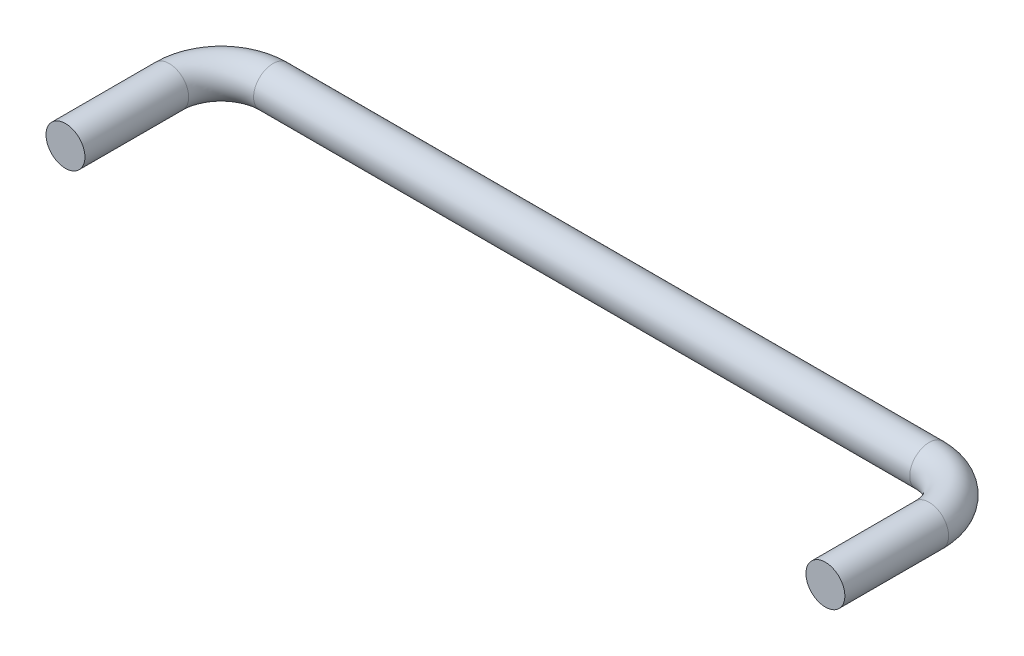
ISO-10303-21;
HEADER;
FILE_DESCRIPTION(('STEP AP214'),'2;1');
FILE_NAME('part.step','',(''),(''),'','','');
FILE_SCHEMA(('AUTOMOTIVE_DESIGN { 1 0 10303 214 1 1 1 1 }'));
ENDSEC;
DATA;
#1=APPLICATION_CONTEXT('core data for automotive mechanical design processes');
#2=APPLICATION_PROTOCOL_DEFINITION('international standard','automotive_design',2000,#1);
#3=PRODUCT_CONTEXT('',#1,'mechanical');
#4=PRODUCT('Part','Part','',(#3));
#5=PRODUCT_RELATED_PRODUCT_CATEGORY('part','',(#4));
#6=PRODUCT_DEFINITION_FORMATION('','',#4);
#7=PRODUCT_DEFINITION_CONTEXT('part definition',#1,'design');
#8=PRODUCT_DEFINITION('design','',#6,#7);
#9=PRODUCT_DEFINITION_SHAPE('','',#8);
#10=(LENGTH_UNIT() NAMED_UNIT(*) SI_UNIT(.MILLI.,.METRE.));
#11=(NAMED_UNIT(*) PLANE_ANGLE_UNIT() SI_UNIT($,.RADIAN.));
#12=(NAMED_UNIT(*) SI_UNIT($,.STERADIAN.) SOLID_ANGLE_UNIT());
#13=UNCERTAINTY_MEASURE_WITH_UNIT(LENGTH_MEASURE(1.E-05),#10,'distance_accuracy_value','');
#14=(GEOMETRIC_REPRESENTATION_CONTEXT(3) GLOBAL_UNCERTAINTY_ASSIGNED_CONTEXT((#13)) GLOBAL_UNIT_ASSIGNED_CONTEXT((#10,
#11,#12)) REPRESENTATION_CONTEXT('',''));
#15=CARTESIAN_POINT('',(0.,0.,0.));
#16=DIRECTION('',(0.,0.,1.));
#17=DIRECTION('',(1.,0.,0.));
#18=AXIS2_PLACEMENT_3D('',#15,#16,#17);
#19=CARTESIAN_POINT('',(0.,0.,0.));
#20=DIRECTION('',(0.,0.,1.));
#21=DIRECTION('',(1.,0.,0.));
#22=AXIS2_PLACEMENT_3D('',#19,#20,#21);
#23=PLANE('',#22);
#24=CARTESIAN_POINT('',(0.,0.,0.));
#25=DIRECTION('',(0.,0.,1.));
#26=DIRECTION('',(1.,0.,0.));
#27=AXIS2_PLACEMENT_3D('',#24,#25,#26);
#28=CIRCLE('',#27,3.75);
#29=CARTESIAN_POINT('',(3.75,0.,0.));
#30=VERTEX_POINT('',#29);
#31=EDGE_CURVE('E58',#30,#30,#28,.T.);
#32=ORIENTED_EDGE('',*,*,#31,.T.);
#33=EDGE_LOOP('',(#32));
#34=FACE_BOUND('',#33,.T.);
#35=ADVANCED_FACE('F36',(#34),#23,.T.);
#36=CARTESIAN_POINT('',(146.4548,0.,0.));
#37=DIRECTION('',(0.,0.,-1.));
#38=DIRECTION('',(-1.,0.,0.));
#39=AXIS2_PLACEMENT_3D('',#36,#37,#38);
#40=PLANE('',#39);
#41=CARTESIAN_POINT('',(146.4548,0.,0.));
#42=DIRECTION('',(0.,0.,-1.));
#43=DIRECTION('',(-1.,0.,0.));
#44=AXIS2_PLACEMENT_3D('',#41,#42,#43);
#45=CIRCLE('',#44,3.75);
#46=CARTESIAN_POINT('',(142.7048,0.,0.));
#47=VERTEX_POINT('',#46);
#48=EDGE_CURVE('E10',#47,#47,#45,.T.);
#49=ORIENTED_EDGE('',*,*,#48,.F.);
#50=EDGE_LOOP('',(#49));
#51=FACE_BOUND('',#50,.T.);
#52=ADVANCED_FACE('F66',(#51),#40,.F.);
#53=CARTESIAN_POINT('',(0.,0.,0.));
#54=DIRECTION('',(0.,0.,-1.));
#55=DIRECTION('',(-1.,0.,0.));
#56=AXIS2_PLACEMENT_3D('',#53,#54,#55);
#57=CYLINDRICAL_SURFACE('',#56,3.75);
#58=CARTESIAN_POINT('',(0.,0.,-19.9999999999999));
#59=DIRECTION('',(0.,0.,1.));
#60=DIRECTION('',(1.,0.,0.));
#61=AXIS2_PLACEMENT_3D('',#58,#59,#60);
#62=CIRCLE('',#61,3.75);
#63=CARTESIAN_POINT('',(-3.75,0.,-19.9999999999999));
#64=VERTEX_POINT('',#63);
#65=EDGE_CURVE('E55',#64,#64,#62,.T.);
#66=ORIENTED_EDGE('',*,*,#65,.T.);
#67=EDGE_LOOP('',(#66));
#68=FACE_BOUND('',#67,.T.);
#69=ORIENTED_EDGE('',*,*,#31,.F.);
#70=EDGE_LOOP('',(#69));
#71=FACE_BOUND('',#70,.T.);
#72=ADVANCED_FACE('F63',(#68,#71),#57,.T.);
#73=CARTESIAN_POINT('',(10.,0.,-20.));
#74=DIRECTION('',(0.,-1.,0.));
#75=DIRECTION('',(0.,0.,-1.));
#76=AXIS2_PLACEMENT_3D('',#73,#74,#75);
#77=TOROIDAL_SURFACE('',#76,10.,3.75);
#78=CARTESIAN_POINT('',(10.0000000000001,0.,-30.));
#79=DIRECTION('',(-1.,0.,0.));
#80=DIRECTION('',(0.,0.,1.));
#81=AXIS2_PLACEMENT_3D('',#78,#79,#80);
#82=CIRCLE('',#81,3.75);
#83=CARTESIAN_POINT('',(10.0000000000001,0.,-33.75));
#84=VERTEX_POINT('',#83);
#85=EDGE_CURVE('E50',#84,#84,#82,.T.);
#86=CARTESIAN_POINT('',(10.,0.,-20.));
#87=DIRECTION('',(0.,-1.,0.));
#88=DIRECTION('',(0.,0.,-1.));
#89=AXIS2_PLACEMENT_3D('',#86,#87,#88);
#90=CIRCLE('',#89,13.75);
#91=EDGE_CURVE('',#64,#84,#90,.T.);
#92=ORIENTED_EDGE('',*,*,#65,.F.);
#93=ORIENTED_EDGE('',*,*,#85,.T.);
#94=ORIENTED_EDGE('',*,*,#91,.T.);
#95=ORIENTED_EDGE('',*,*,#91,.F.);
#96=EDGE_LOOP('',(#92,#94,#93,#95));
#97=FACE_BOUND('',#96,.T.);
#98=ADVANCED_FACE('F65',(#97),#77,.T.);
#99=CARTESIAN_POINT('',(10.0000000000001,0.,-30.));
#100=DIRECTION('',(1.,0.,0.));
#101=DIRECTION('',(0.,0.,-1.));
#102=AXIS2_PLACEMENT_3D('',#99,#100,#101);
#103=CYLINDRICAL_SURFACE('',#102,3.75);
#104=CARTESIAN_POINT('',(136.4548,0.,-30.));
#105=DIRECTION('',(-1.,0.,0.));
#106=DIRECTION('',(0.,0.,1.));
#107=AXIS2_PLACEMENT_3D('',#104,#105,#106);
#108=CIRCLE('',#107,3.75);
#109=CARTESIAN_POINT('',(136.4548,0.,-33.75));
#110=VERTEX_POINT('',#109);
#111=EDGE_CURVE('E46',#110,#110,#108,.T.);
#112=ORIENTED_EDGE('',*,*,#111,.T.);
#113=EDGE_LOOP('',(#112));
#114=FACE_BOUND('',#113,.T.);
#115=ORIENTED_EDGE('',*,*,#85,.F.);
#116=EDGE_LOOP('',(#115));
#117=FACE_BOUND('',#116,.T.);
#118=ADVANCED_FACE('F73',(#114,#117),#103,.T.);
#119=CARTESIAN_POINT('',(136.4548,0.,-20.));
#120=DIRECTION('',(0.,-1.,0.));
#121=DIRECTION('',(0.,0.,-1.));
#122=AXIS2_PLACEMENT_3D('',#119,#120,#121);
#123=TOROIDAL_SURFACE('',#122,10.,3.75);
#124=CARTESIAN_POINT('',(146.4548,0.,-20.));
#125=DIRECTION('',(0.,0.,-1.));
#126=DIRECTION('',(-1.,0.,0.));
#127=AXIS2_PLACEMENT_3D('',#124,#125,#126);
#128=CIRCLE('',#127,3.75);
#129=CARTESIAN_POINT('',(150.2048,0.,-20.));
#130=VERTEX_POINT('',#129);
#131=EDGE_CURVE('E42',#130,#130,#128,.T.);
#132=CARTESIAN_POINT('',(136.4548,0.,-20.));
#133=DIRECTION('',(0.,-1.,0.));
#134=DIRECTION('',(0.,0.,-1.));
#135=AXIS2_PLACEMENT_3D('',#132,#133,#134);
#136=CIRCLE('',#135,13.75);
#137=EDGE_CURVE('',#110,#130,#136,.T.);
#138=ORIENTED_EDGE('',*,*,#111,.F.);
#139=ORIENTED_EDGE('',*,*,#131,.T.);
#140=ORIENTED_EDGE('',*,*,#137,.T.);
#141=ORIENTED_EDGE('',*,*,#137,.F.);
#142=EDGE_LOOP('',(#138,#140,#139,#141));
#143=FACE_BOUND('',#142,.T.);
#144=ADVANCED_FACE('F79',(#143),#123,.T.);
#145=CARTESIAN_POINT('',(146.4548,0.,-20.));
#146=DIRECTION('',(0.,0.,1.));
#147=DIRECTION('',(1.,0.,0.));
#148=AXIS2_PLACEMENT_3D('',#145,#146,#147);
#149=CYLINDRICAL_SURFACE('',#148,3.75);
#150=ORIENTED_EDGE('',*,*,#48,.T.);
#151=EDGE_LOOP('',(#150));
#152=FACE_BOUND('',#151,.T.);
#153=ORIENTED_EDGE('',*,*,#131,.F.);
#154=EDGE_LOOP('',(#153));
#155=FACE_BOUND('',#154,.T.);
#156=ADVANCED_FACE('F77',(#152,#155),#149,.T.);
#157=CLOSED_SHELL('',(#35,#52,#72,#98,#118,#144,#156));
#158=MANIFOLD_SOLID_BREP('B2',#157);
#159=ADVANCED_BREP_SHAPE_REPRESENTATION('',(#18,#158),#14);
#160=SHAPE_DEFINITION_REPRESENTATION(#9,#159);
ENDSEC;
END-ISO-10303-21;
